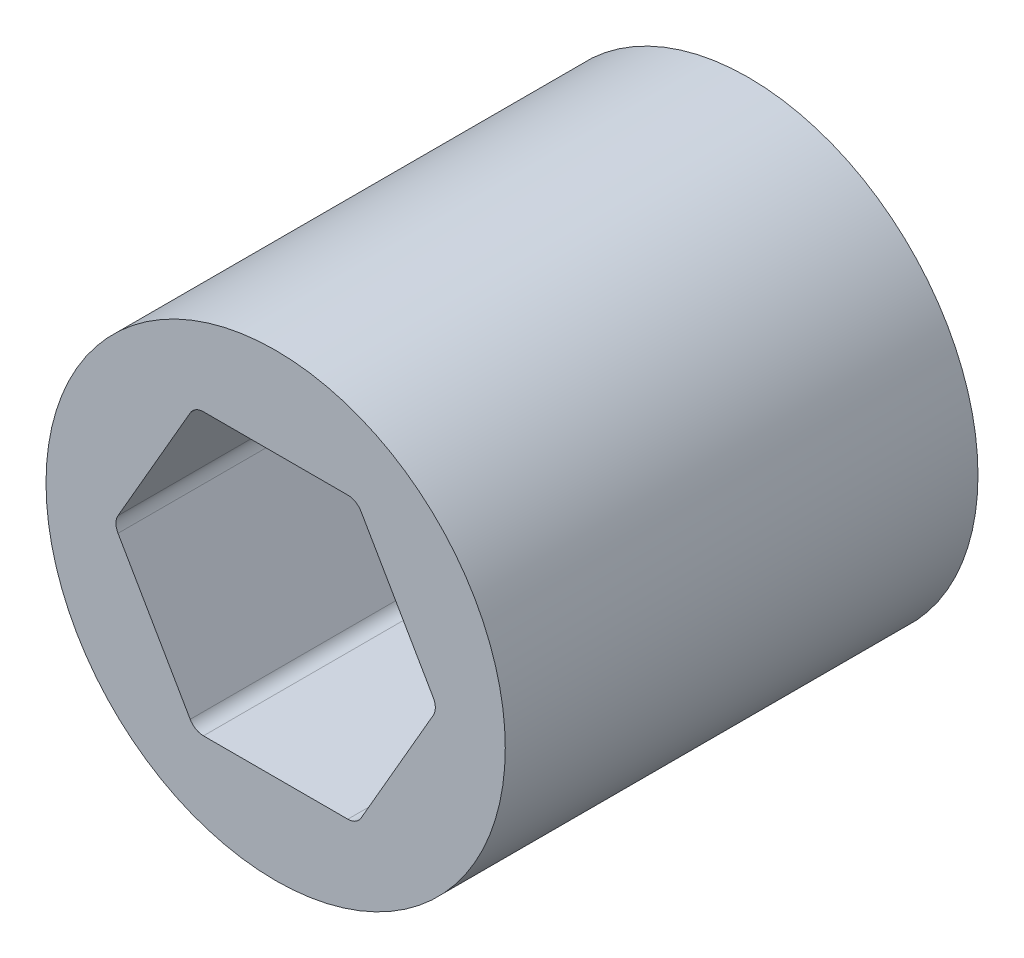
ISO-10303-21;
HEADER;
FILE_DESCRIPTION(('STEP AP214'),'2;1');
FILE_NAME('part.step','',(''),(''),'','','');
FILE_SCHEMA(('AUTOMOTIVE_DESIGN { 1 0 10303 214 1 1 1 1 }'));
ENDSEC;
DATA;
#1=APPLICATION_CONTEXT('core data for automotive mechanical design processes');
#2=APPLICATION_PROTOCOL_DEFINITION('international standard','automotive_design',2000,#1);
#3=PRODUCT_CONTEXT('',#1,'mechanical');
#4=PRODUCT('Part','Part','',(#3));
#5=PRODUCT_RELATED_PRODUCT_CATEGORY('part','',(#4));
#6=PRODUCT_DEFINITION_FORMATION('','',#4);
#7=PRODUCT_DEFINITION_CONTEXT('part definition',#1,'design');
#8=PRODUCT_DEFINITION('design','',#6,#7);
#9=PRODUCT_DEFINITION_SHAPE('','',#8);
#10=(LENGTH_UNIT() NAMED_UNIT(*) SI_UNIT(.MILLI.,.METRE.));
#11=(NAMED_UNIT(*) PLANE_ANGLE_UNIT() SI_UNIT($,.RADIAN.));
#12=(NAMED_UNIT(*) SI_UNIT($,.STERADIAN.) SOLID_ANGLE_UNIT());
#13=UNCERTAINTY_MEASURE_WITH_UNIT(LENGTH_MEASURE(1.E-05),#10,'distance_accuracy_value','');
#14=(GEOMETRIC_REPRESENTATION_CONTEXT(3) GLOBAL_UNCERTAINTY_ASSIGNED_CONTEXT((#13)) GLOBAL_UNIT_ASSIGNED_CONTEXT((#10,
#11,#12)) REPRESENTATION_CONTEXT('',''));
#15=CARTESIAN_POINT('',(0.,0.,0.));
#16=DIRECTION('',(0.,0.,1.));
#17=DIRECTION('',(1.,0.,0.));
#18=AXIS2_PLACEMENT_3D('',#15,#16,#17);
#19=CARTESIAN_POINT('',(0.,0.,11.764075024));
#20=DIRECTION('',(0.,0.,1.));
#21=DIRECTION('',(1.,0.,0.));
#22=AXIS2_PLACEMENT_3D('',#19,#20,#21);
#23=PLANE('',#22);
#24=CARTESIAN_POINT('',(0.,0.,11.764075024));
#25=DIRECTION('',(0.,0.,1.));
#26=DIRECTION('',(1.,0.,0.));
#27=AXIS2_PLACEMENT_3D('',#24,#25,#26);
#28=CIRCLE('',#27,11.43);
#29=CARTESIAN_POINT('',(11.43,0.,11.764075024));
#30=VERTEX_POINT('',#29);
#31=EDGE_CURVE('E11',#30,#30,#28,.T.);
#32=ORIENTED_EDGE('',*,*,#31,.T.);
#33=EDGE_LOOP('',(#32));
#34=FACE_BOUND('',#33,.T.);
#35=DIRECTION('',(0.500000000000001,-0.866025403784438,0.));
#36=VECTOR('',#35,1.);
#37=CARTESIAN_POINT('',(-7.84561280801782,-0.381000000000008,11.764075024));
#38=LINE('',#37,#36);
#39=CARTESIAN_POINT('',(-7.84561280801782,-0.381000000000008,11.764075024));
#40=VERTEX_POINT('',#39);
#41=CARTESIAN_POINT('',(-4.25276208285078,-6.604,11.764075024));
#42=VERTEX_POINT('',#41);
#43=EDGE_CURVE('E130',#40,#42,#38,.T.);
#44=ORIENTED_EDGE('',*,*,#43,.F.);
#45=CARTESIAN_POINT('',(-7.18570145033408,0.,11.764075024));
#46=DIRECTION('',(0.,0.,1.));
#47=DIRECTION('',(1.,0.,0.));
#48=AXIS2_PLACEMENT_3D('',#45,#46,#47);
#49=CIRCLE('',#48,0.762000000000001);
#50=CARTESIAN_POINT('',(-7.84561280801782,0.380999999999998,11.764075024));
#51=VERTEX_POINT('',#50);
#52=EDGE_CURVE('E122',#51,#40,#49,.T.);
#53=ORIENTED_EDGE('',*,*,#52,.F.);
#54=DIRECTION('',(-0.5,-0.866025403784439,0.));
#55=VECTOR('',#54,1.);
#56=CARTESIAN_POINT('',(-4.25276208285078,6.60399999999999,11.764075024));
#57=LINE('',#56,#55);
#58=CARTESIAN_POINT('',(-4.25276208285078,6.60399999999999,11.764075024));
#59=VERTEX_POINT('',#58);
#60=EDGE_CURVE('E162',#59,#51,#57,.T.);
#61=ORIENTED_EDGE('',*,*,#60,.F.);
#62=CARTESIAN_POINT('',(-3.59285072516704,6.223,11.764075024));
#63=DIRECTION('',(0.,0.,1.));
#64=DIRECTION('',(1.,0.,0.));
#65=AXIS2_PLACEMENT_3D('',#62,#63,#64);
#66=CIRCLE('',#65,0.762);
#67=CARTESIAN_POINT('',(-3.59285072516704,6.985,11.764075024));
#68=VERTEX_POINT('',#67);
#69=EDGE_CURVE('E160',#68,#59,#66,.T.);
#70=ORIENTED_EDGE('',*,*,#69,.F.);
#71=DIRECTION('',(-1.,0.,0.));
#72=VECTOR('',#71,1.);
#73=CARTESIAN_POINT('',(3.59285072516703,6.985,11.764075024));
#74=LINE('',#73,#72);
#75=CARTESIAN_POINT('',(3.59285072516703,6.985,11.764075024));
#76=VERTEX_POINT('',#75);
#77=EDGE_CURVE('E158',#76,#68,#74,.T.);
#78=ORIENTED_EDGE('',*,*,#77,.F.);
#79=CARTESIAN_POINT('',(3.59285072516704,6.223,11.764075024));
#80=DIRECTION('',(0.,0.,1.));
#81=DIRECTION('',(-1.,0.,0.));
#82=AXIS2_PLACEMENT_3D('',#79,#80,#81);
#83=CIRCLE('',#82,0.762);
#84=CARTESIAN_POINT('',(4.25276208285078,6.604,11.764075024));
#85=VERTEX_POINT('',#84);
#86=EDGE_CURVE('E156',#85,#76,#83,.T.);
#87=ORIENTED_EDGE('',*,*,#86,.F.);
#88=DIRECTION('',(-0.5,0.866025403784439,0.));
#89=VECTOR('',#88,1.);
#90=CARTESIAN_POINT('',(7.84561280801782,0.381000000000005,11.764075024));
#91=LINE('',#90,#89);
#92=CARTESIAN_POINT('',(7.84561280801782,0.381000000000005,11.764075024));
#93=VERTEX_POINT('',#92);
#94=EDGE_CURVE('E154',#93,#85,#91,.T.);
#95=ORIENTED_EDGE('',*,*,#94,.F.);
#96=CARTESIAN_POINT('',(7.18570145033408,0.,11.764075024));
#97=DIRECTION('',(0.,0.,1.));
#98=DIRECTION('',(1.,0.,0.));
#99=AXIS2_PLACEMENT_3D('',#96,#97,#98);
#100=CIRCLE('',#99,0.762000000000001);
#101=CARTESIAN_POINT('',(7.84561280801782,-0.381000000000002,11.764075024));
#102=VERTEX_POINT('',#101);
#103=EDGE_CURVE('E152',#102,#93,#100,.T.);
#104=ORIENTED_EDGE('',*,*,#103,.F.);
#105=DIRECTION('',(0.5,0.866025403784439,0.));
#106=VECTOR('',#105,1.);
#107=CARTESIAN_POINT('',(4.25276208285079,-6.60399999999999,11.764075024));
#108=LINE('',#107,#106);
#109=CARTESIAN_POINT('',(4.25276208285079,-6.60399999999999,11.764075024));
#110=VERTEX_POINT('',#109);
#111=EDGE_CURVE('E150',#110,#102,#108,.T.);
#112=ORIENTED_EDGE('',*,*,#111,.F.);
#113=CARTESIAN_POINT('',(3.59285072516704,-6.223,11.764075024));
#114=DIRECTION('',(0.,0.,1.));
#115=DIRECTION('',(1.,0.,0.));
#116=AXIS2_PLACEMENT_3D('',#113,#114,#115);
#117=CIRCLE('',#116,0.762);
#118=CARTESIAN_POINT('',(3.59285072516704,-6.985,11.764075024));
#119=VERTEX_POINT('',#118);
#120=EDGE_CURVE('E148',#119,#110,#117,.T.);
#121=ORIENTED_EDGE('',*,*,#120,.F.);
#122=DIRECTION('',(1.,0.,0.));
#123=VECTOR('',#122,1.);
#124=CARTESIAN_POINT('',(-3.59285072516703,-6.985,11.764075024));
#125=LINE('',#124,#123);
#126=CARTESIAN_POINT('',(-3.59285072516703,-6.985,11.764075024));
#127=VERTEX_POINT('',#126);
#128=EDGE_CURVE('E144',#127,#119,#125,.T.);
#129=ORIENTED_EDGE('',*,*,#128,.F.);
#130=CARTESIAN_POINT('',(-3.59285072516703,-6.223,11.764075024));
#131=DIRECTION('',(0.,0.,1.));
#132=DIRECTION('',(1.,0.,0.));
#133=AXIS2_PLACEMENT_3D('',#130,#131,#132);
#134=CIRCLE('',#133,0.762);
#135=EDGE_CURVE('E142',#42,#127,#134,.T.);
#136=ORIENTED_EDGE('',*,*,#135,.F.);
#137=EDGE_LOOP('',(#44,#53,#61,#70,#78,#87,#95,#104,#112,#121,#129,#136));
#138=FACE_BOUND('',#137,.T.);
#139=ADVANCED_FACE('F33',(#34,#138),#23,.T.);
#140=CARTESIAN_POINT('',(0.,0.,-11.764075024));
#141=DIRECTION('',(0.,0.,1.));
#142=DIRECTION('',(1.,0.,0.));
#143=AXIS2_PLACEMENT_3D('',#140,#141,#142);
#144=PLANE('',#143);
#145=CARTESIAN_POINT('',(0.,0.,-11.764075024));
#146=DIRECTION('',(0.,0.,1.));
#147=DIRECTION('',(1.,0.,0.));
#148=AXIS2_PLACEMENT_3D('',#145,#146,#147);
#149=CIRCLE('',#148,11.43);
#150=CARTESIAN_POINT('',(11.43,0.,-11.764075024));
#151=VERTEX_POINT('',#150);
#152=EDGE_CURVE('E37',#151,#151,#149,.T.);
#153=ORIENTED_EDGE('',*,*,#152,.F.);
#154=EDGE_LOOP('',(#153));
#155=FACE_BOUND('',#154,.T.);
#156=CARTESIAN_POINT('',(-7.18570145033408,0.,-11.764075024));
#157=DIRECTION('',(0.,0.,1.));
#158=DIRECTION('',(1.,0.,0.));
#159=AXIS2_PLACEMENT_3D('',#156,#157,#158);
#160=CIRCLE('',#159,0.762000000000001);
#161=CARTESIAN_POINT('',(-7.84561280801782,0.380999999999998,-11.764075024));
#162=VERTEX_POINT('',#161);
#163=CARTESIAN_POINT('',(-7.84561280801782,-0.381000000000008,-11.764075024));
#164=VERTEX_POINT('',#163);
#165=EDGE_CURVE('E56',#162,#164,#160,.T.);
#166=ORIENTED_EDGE('',*,*,#165,.T.);
#167=DIRECTION('',(0.500000000000001,-0.866025403784438,0.));
#168=VECTOR('',#167,1.);
#169=CARTESIAN_POINT('',(-7.84561280801782,-0.381000000000008,-11.764075024));
#170=LINE('',#169,#168);
#171=CARTESIAN_POINT('',(-4.25276208285078,-6.604,-11.764075024));
#172=VERTEX_POINT('',#171);
#173=EDGE_CURVE('E137',#164,#172,#170,.T.);
#174=ORIENTED_EDGE('',*,*,#173,.T.);
#175=CARTESIAN_POINT('',(-3.59285072516703,-6.223,-11.764075024));
#176=DIRECTION('',(0.,0.,1.));
#177=DIRECTION('',(1.,0.,0.));
#178=AXIS2_PLACEMENT_3D('',#175,#176,#177);
#179=CIRCLE('',#178,0.762);
#180=CARTESIAN_POINT('',(-3.59285072516703,-6.985,-11.764075024));
#181=VERTEX_POINT('',#180);
#182=EDGE_CURVE('E166',#172,#181,#179,.T.);
#183=ORIENTED_EDGE('',*,*,#182,.T.);
#184=DIRECTION('',(1.,0.,0.));
#185=VECTOR('',#184,1.);
#186=CARTESIAN_POINT('',(-3.59285072516703,-6.985,-11.764075024));
#187=LINE('',#186,#185);
#188=CARTESIAN_POINT('',(3.59285072516704,-6.985,-11.764075024));
#189=VERTEX_POINT('',#188);
#190=EDGE_CURVE('E169',#181,#189,#187,.T.);
#191=ORIENTED_EDGE('',*,*,#190,.T.);
#192=CARTESIAN_POINT('',(3.59285072516704,-6.223,-11.764075024));
#193=DIRECTION('',(0.,0.,1.));
#194=DIRECTION('',(1.,0.,0.));
#195=AXIS2_PLACEMENT_3D('',#192,#193,#194);
#196=CIRCLE('',#195,0.762);
#197=CARTESIAN_POINT('',(4.25276208285079,-6.60399999999999,-11.764075024));
#198=VERTEX_POINT('',#197);
#199=EDGE_CURVE('E172',#189,#198,#196,.T.);
#200=ORIENTED_EDGE('',*,*,#199,.T.);
#201=DIRECTION('',(0.5,0.866025403784439,0.));
#202=VECTOR('',#201,1.);
#203=CARTESIAN_POINT('',(4.25276208285079,-6.60399999999999,-11.764075024));
#204=LINE('',#203,#202);
#205=CARTESIAN_POINT('',(7.84561280801782,-0.381000000000002,-11.764075024));
#206=VERTEX_POINT('',#205);
#207=EDGE_CURVE('E175',#198,#206,#204,.T.);
#208=ORIENTED_EDGE('',*,*,#207,.T.);
#209=CARTESIAN_POINT('',(7.18570145033408,0.,-11.764075024));
#210=DIRECTION('',(0.,0.,1.));
#211=DIRECTION('',(1.,0.,0.));
#212=AXIS2_PLACEMENT_3D('',#209,#210,#211);
#213=CIRCLE('',#212,0.762000000000001);
#214=CARTESIAN_POINT('',(7.84561280801782,0.381000000000005,-11.764075024));
#215=VERTEX_POINT('',#214);
#216=EDGE_CURVE('E178',#206,#215,#213,.T.);
#217=ORIENTED_EDGE('',*,*,#216,.T.);
#218=DIRECTION('',(-0.5,0.866025403784439,0.));
#219=VECTOR('',#218,1.);
#220=CARTESIAN_POINT('',(7.84561280801782,0.381000000000005,-11.764075024));
#221=LINE('',#220,#219);
#222=CARTESIAN_POINT('',(4.25276208285078,6.604,-11.764075024));
#223=VERTEX_POINT('',#222);
#224=EDGE_CURVE('E181',#215,#223,#221,.T.);
#225=ORIENTED_EDGE('',*,*,#224,.T.);
#226=CARTESIAN_POINT('',(3.59285072516704,6.223,-11.764075024));
#227=DIRECTION('',(0.,0.,1.));
#228=DIRECTION('',(-1.,0.,0.));
#229=AXIS2_PLACEMENT_3D('',#226,#227,#228);
#230=CIRCLE('',#229,0.762);
#231=CARTESIAN_POINT('',(3.59285072516703,6.985,-11.764075024));
#232=VERTEX_POINT('',#231);
#233=EDGE_CURVE('E184',#223,#232,#230,.T.);
#234=ORIENTED_EDGE('',*,*,#233,.T.);
#235=DIRECTION('',(-1.,0.,0.));
#236=VECTOR('',#235,1.);
#237=CARTESIAN_POINT('',(3.59285072516703,6.985,-11.764075024));
#238=LINE('',#237,#236);
#239=CARTESIAN_POINT('',(-3.59285072516704,6.985,-11.764075024));
#240=VERTEX_POINT('',#239);
#241=EDGE_CURVE('E187',#232,#240,#238,.T.);
#242=ORIENTED_EDGE('',*,*,#241,.T.);
#243=CARTESIAN_POINT('',(-3.59285072516704,6.223,-11.764075024));
#244=DIRECTION('',(0.,0.,1.));
#245=DIRECTION('',(1.,0.,0.));
#246=AXIS2_PLACEMENT_3D('',#243,#244,#245);
#247=CIRCLE('',#246,0.762);
#248=CARTESIAN_POINT('',(-4.25276208285078,6.60399999999999,-11.764075024));
#249=VERTEX_POINT('',#248);
#250=EDGE_CURVE('E190',#240,#249,#247,.T.);
#251=ORIENTED_EDGE('',*,*,#250,.T.);
#252=DIRECTION('',(-0.5,-0.866025403784439,0.));
#253=VECTOR('',#252,1.);
#254=CARTESIAN_POINT('',(-4.25276208285078,6.60399999999999,-11.764075024));
#255=LINE('',#254,#253);
#256=EDGE_CURVE('E131',#249,#162,#255,.T.);
#257=ORIENTED_EDGE('',*,*,#256,.T.);
#258=EDGE_LOOP('',(#166,#174,#183,#191,#200,#208,#217,#225,#234,#242,#251,#257));
#259=FACE_BOUND('',#258,.T.);
#260=ADVANCED_FACE('F219',(#155,#259),#144,.F.);
#261=CARTESIAN_POINT('',(0.,0.,11.764075024));
#262=DIRECTION('',(0.,0.,-1.));
#263=DIRECTION('',(-1.,0.,0.));
#264=AXIS2_PLACEMENT_3D('',#261,#262,#263);
#265=CYLINDRICAL_SURFACE('',#264,11.43);
#266=ORIENTED_EDGE('',*,*,#31,.F.);
#267=EDGE_LOOP('',(#266));
#268=FACE_BOUND('',#267,.T.);
#269=ORIENTED_EDGE('',*,*,#152,.T.);
#270=EDGE_LOOP('',(#269));
#271=FACE_BOUND('',#270,.T.);
#272=ADVANCED_FACE('F35',(#268,#271),#265,.T.);
#273=CARTESIAN_POINT('',(-7.18570145033408,0.,11.764075024));
#274=DIRECTION('',(0.,0.,-1.));
#275=DIRECTION('',(-1.,0.,0.));
#276=AXIS2_PLACEMENT_3D('',#273,#274,#275);
#277=CYLINDRICAL_SURFACE('',#276,0.762000000000001);
#278=ORIENTED_EDGE('',*,*,#165,.F.);
#279=DIRECTION('',(0.,0.,-1.));
#280=VECTOR('',#279,1.);
#281=CARTESIAN_POINT('',(-7.84561280801782,0.380999999999998,11.764075024));
#282=LINE('',#281,#280);
#283=EDGE_CURVE('E126',#51,#162,#282,.T.);
#284=ORIENTED_EDGE('',*,*,#283,.F.);
#285=ORIENTED_EDGE('',*,*,#52,.T.);
#286=DIRECTION('',(0.,0.,-1.));
#287=VECTOR('',#286,1.);
#288=CARTESIAN_POINT('',(-7.84561280801782,-0.381000000000008,11.764075024));
#289=LINE('',#288,#287);
#290=EDGE_CURVE('E125',#40,#164,#289,.T.);
#291=ORIENTED_EDGE('',*,*,#290,.T.);
#292=EDGE_LOOP('',(#278,#284,#285,#291));
#293=FACE_BOUND('',#292,.T.);
#294=ADVANCED_FACE('F124',(#293),#277,.F.);
#295=CARTESIAN_POINT('',(-7.84561280801782,-0.381000000000008,11.764075024));
#296=DIRECTION('',(0.866025403784438,0.500000000000001,0.));
#297=DIRECTION('',(-0.500000000000001,0.866025403784438,0.));
#298=AXIS2_PLACEMENT_3D('',#295,#296,#297);
#299=PLANE('',#298);
#300=ORIENTED_EDGE('',*,*,#173,.F.);
#301=ORIENTED_EDGE('',*,*,#290,.F.);
#302=ORIENTED_EDGE('',*,*,#43,.T.);
#303=DIRECTION('',(0.,0.,-1.));
#304=VECTOR('',#303,1.);
#305=CARTESIAN_POINT('',(-4.25276208285078,-6.604,11.764075024));
#306=LINE('',#305,#304);
#307=EDGE_CURVE('E138',#42,#172,#306,.T.);
#308=ORIENTED_EDGE('',*,*,#307,.T.);
#309=EDGE_LOOP('',(#300,#301,#302,#308));
#310=FACE_BOUND('',#309,.T.);
#311=ADVANCED_FACE('F134',(#310),#299,.T.);
#312=CARTESIAN_POINT('',(-3.59285072516703,-6.223,11.764075024));
#313=DIRECTION('',(0.,0.,-1.));
#314=DIRECTION('',(-1.,0.,0.));
#315=AXIS2_PLACEMENT_3D('',#312,#313,#314);
#316=CYLINDRICAL_SURFACE('',#315,0.762);
#317=ORIENTED_EDGE('',*,*,#182,.F.);
#318=ORIENTED_EDGE('',*,*,#307,.F.);
#319=ORIENTED_EDGE('',*,*,#135,.T.);
#320=DIRECTION('',(0.,0.,-1.));
#321=VECTOR('',#320,1.);
#322=CARTESIAN_POINT('',(-3.59285072516703,-6.985,11.764075024));
#323=LINE('',#322,#321);
#324=EDGE_CURVE('E211',#127,#181,#323,.T.);
#325=ORIENTED_EDGE('',*,*,#324,.T.);
#326=EDGE_LOOP('',(#317,#318,#319,#325));
#327=FACE_BOUND('',#326,.T.);
#328=ADVANCED_FACE('F215',(#327),#316,.F.);
#329=CARTESIAN_POINT('',(-3.59285072516703,-6.985,11.764075024));
#330=DIRECTION('',(0.,1.,0.));
#331=DIRECTION('',(-1.,0.,0.));
#332=AXIS2_PLACEMENT_3D('',#329,#330,#331);
#333=PLANE('',#332);
#334=ORIENTED_EDGE('',*,*,#190,.F.);
#335=ORIENTED_EDGE('',*,*,#324,.F.);
#336=ORIENTED_EDGE('',*,*,#128,.T.);
#337=DIRECTION('',(0.,0.,-1.));
#338=VECTOR('',#337,1.);
#339=CARTESIAN_POINT('',(3.59285072516704,-6.985,11.764075024));
#340=LINE('',#339,#338);
#341=EDGE_CURVE('E209',#119,#189,#340,.T.);
#342=ORIENTED_EDGE('',*,*,#341,.T.);
#343=EDGE_LOOP('',(#334,#335,#336,#342));
#344=FACE_BOUND('',#343,.T.);
#345=ADVANCED_FACE('F257',(#344),#333,.T.);
#346=CARTESIAN_POINT('',(3.59285072516704,-6.223,11.764075024));
#347=DIRECTION('',(0.,0.,-1.));
#348=DIRECTION('',(-1.,0.,0.));
#349=AXIS2_PLACEMENT_3D('',#346,#347,#348);
#350=CYLINDRICAL_SURFACE('',#349,0.762);
#351=ORIENTED_EDGE('',*,*,#199,.F.);
#352=ORIENTED_EDGE('',*,*,#341,.F.);
#353=ORIENTED_EDGE('',*,*,#120,.T.);
#354=DIRECTION('',(0.,0.,-1.));
#355=VECTOR('',#354,1.);
#356=CARTESIAN_POINT('',(4.25276208285079,-6.60399999999999,11.764075024));
#357=LINE('',#356,#355);
#358=EDGE_CURVE('E207',#110,#198,#357,.T.);
#359=ORIENTED_EDGE('',*,*,#358,.T.);
#360=EDGE_LOOP('',(#351,#352,#353,#359));
#361=FACE_BOUND('',#360,.T.);
#362=ADVANCED_FACE('F255',(#361),#350,.F.);
#363=CARTESIAN_POINT('',(4.25276208285079,-6.60399999999999,11.764075024));
#364=DIRECTION('',(-0.866025403784439,0.5,0.));
#365=DIRECTION('',(-0.5,-0.866025403784439,0.));
#366=AXIS2_PLACEMENT_3D('',#363,#364,#365);
#367=PLANE('',#366);
#368=ORIENTED_EDGE('',*,*,#207,.F.);
#369=ORIENTED_EDGE('',*,*,#358,.F.);
#370=ORIENTED_EDGE('',*,*,#111,.T.);
#371=DIRECTION('',(0.,0.,-1.));
#372=VECTOR('',#371,1.);
#373=CARTESIAN_POINT('',(7.84561280801782,-0.381000000000002,11.764075024));
#374=LINE('',#373,#372);
#375=EDGE_CURVE('E205',#102,#206,#374,.T.);
#376=ORIENTED_EDGE('',*,*,#375,.T.);
#377=EDGE_LOOP('',(#368,#369,#370,#376));
#378=FACE_BOUND('',#377,.T.);
#379=ADVANCED_FACE('F249',(#378),#367,.T.);
#380=CARTESIAN_POINT('',(7.18570145033408,0.,11.764075024));
#381=DIRECTION('',(0.,0.,-1.));
#382=DIRECTION('',(-1.,0.,0.));
#383=AXIS2_PLACEMENT_3D('',#380,#381,#382);
#384=CYLINDRICAL_SURFACE('',#383,0.762000000000001);
#385=ORIENTED_EDGE('',*,*,#216,.F.);
#386=ORIENTED_EDGE('',*,*,#375,.F.);
#387=ORIENTED_EDGE('',*,*,#103,.T.);
#388=DIRECTION('',(0.,0.,-1.));
#389=VECTOR('',#388,1.);
#390=CARTESIAN_POINT('',(7.84561280801782,0.381000000000005,11.764075024));
#391=LINE('',#390,#389);
#392=EDGE_CURVE('E203',#93,#215,#391,.T.);
#393=ORIENTED_EDGE('',*,*,#392,.T.);
#394=EDGE_LOOP('',(#385,#386,#387,#393));
#395=FACE_BOUND('',#394,.T.);
#396=ADVANCED_FACE('F245',(#395),#384,.F.);
#397=CARTESIAN_POINT('',(7.84561280801782,0.381000000000005,11.764075024));
#398=DIRECTION('',(-0.866025403784439,-0.5,0.));
#399=DIRECTION('',(0.5,-0.866025403784439,0.));
#400=AXIS2_PLACEMENT_3D('',#397,#398,#399);
#401=PLANE('',#400);
#402=ORIENTED_EDGE('',*,*,#224,.F.);
#403=ORIENTED_EDGE('',*,*,#392,.F.);
#404=ORIENTED_EDGE('',*,*,#94,.T.);
#405=DIRECTION('',(0.,0.,-1.));
#406=VECTOR('',#405,1.);
#407=CARTESIAN_POINT('',(4.25276208285078,6.604,11.764075024));
#408=LINE('',#407,#406);
#409=EDGE_CURVE('E201',#85,#223,#408,.T.);
#410=ORIENTED_EDGE('',*,*,#409,.T.);
#411=EDGE_LOOP('',(#402,#403,#404,#410));
#412=FACE_BOUND('',#411,.T.);
#413=ADVANCED_FACE('F242',(#412),#401,.T.);
#414=CARTESIAN_POINT('',(3.59285072516704,6.223,11.764075024));
#415=DIRECTION('',(0.,0.,-1.));
#416=DIRECTION('',(-1.,0.,0.));
#417=AXIS2_PLACEMENT_3D('',#414,#415,#416);
#418=CYLINDRICAL_SURFACE('',#417,0.762);
#419=ORIENTED_EDGE('',*,*,#233,.F.);
#420=ORIENTED_EDGE('',*,*,#409,.F.);
#421=ORIENTED_EDGE('',*,*,#86,.T.);
#422=DIRECTION('',(0.,0.,-1.));
#423=VECTOR('',#422,1.);
#424=CARTESIAN_POINT('',(3.59285072516703,6.985,11.764075024));
#425=LINE('',#424,#423);
#426=EDGE_CURVE('E199',#76,#232,#425,.T.);
#427=ORIENTED_EDGE('',*,*,#426,.T.);
#428=EDGE_LOOP('',(#419,#420,#421,#427));
#429=FACE_BOUND('',#428,.T.);
#430=ADVANCED_FACE('F234',(#429),#418,.F.);
#431=CARTESIAN_POINT('',(3.59285072516703,6.985,11.764075024));
#432=DIRECTION('',(0.,-1.,0.));
#433=DIRECTION('',(1.,0.,0.));
#434=AXIS2_PLACEMENT_3D('',#431,#432,#433);
#435=PLANE('',#434);
#436=ORIENTED_EDGE('',*,*,#241,.F.);
#437=ORIENTED_EDGE('',*,*,#426,.F.);
#438=ORIENTED_EDGE('',*,*,#77,.T.);
#439=DIRECTION('',(0.,0.,-1.));
#440=VECTOR('',#439,1.);
#441=CARTESIAN_POINT('',(-3.59285072516704,6.985,11.764075024));
#442=LINE('',#441,#440);
#443=EDGE_CURVE('E197',#68,#240,#442,.T.);
#444=ORIENTED_EDGE('',*,*,#443,.T.);
#445=EDGE_LOOP('',(#436,#437,#438,#444));
#446=FACE_BOUND('',#445,.T.);
#447=ADVANCED_FACE('F230',(#446),#435,.T.);
#448=CARTESIAN_POINT('',(-3.59285072516704,6.223,11.764075024));
#449=DIRECTION('',(0.,0.,-1.));
#450=DIRECTION('',(-1.,0.,0.));
#451=AXIS2_PLACEMENT_3D('',#448,#449,#450);
#452=CYLINDRICAL_SURFACE('',#451,0.762);
#453=ORIENTED_EDGE('',*,*,#250,.F.);
#454=ORIENTED_EDGE('',*,*,#443,.F.);
#455=ORIENTED_EDGE('',*,*,#69,.T.);
#456=DIRECTION('',(0.,0.,-1.));
#457=VECTOR('',#456,1.);
#458=CARTESIAN_POINT('',(-4.25276208285078,6.60399999999999,11.764075024));
#459=LINE('',#458,#457);
#460=EDGE_CURVE('E48',#59,#249,#459,.T.);
#461=ORIENTED_EDGE('',*,*,#460,.T.);
#462=EDGE_LOOP('',(#453,#454,#455,#461));
#463=FACE_BOUND('',#462,.T.);
#464=ADVANCED_FACE('F227',(#463),#452,.F.);
#465=CARTESIAN_POINT('',(-4.25276208285078,6.60399999999999,11.764075024));
#466=DIRECTION('',(0.866025403784439,-0.5,0.));
#467=DIRECTION('',(0.5,0.866025403784439,0.));
#468=AXIS2_PLACEMENT_3D('',#465,#466,#467);
#469=PLANE('',#468);
#470=ORIENTED_EDGE('',*,*,#256,.F.);
#471=ORIENTED_EDGE('',*,*,#460,.F.);
#472=ORIENTED_EDGE('',*,*,#60,.T.);
#473=ORIENTED_EDGE('',*,*,#283,.T.);
#474=EDGE_LOOP('',(#470,#471,#472,#473));
#475=FACE_BOUND('',#474,.T.);
#476=ADVANCED_FACE('F221',(#475),#469,.T.);
#477=CLOSED_SHELL('',(#139,#260,#272,#294,#311,#328,#345,#362,#379,#396,#413,#430,#447,#464,#476));
#478=MANIFOLD_SOLID_BREP('B2',#477);
#479=ADVANCED_BREP_SHAPE_REPRESENTATION('',(#18,#478),#14);
#480=SHAPE_DEFINITION_REPRESENTATION(#9,#479);
ENDSEC;
END-ISO-10303-21;
